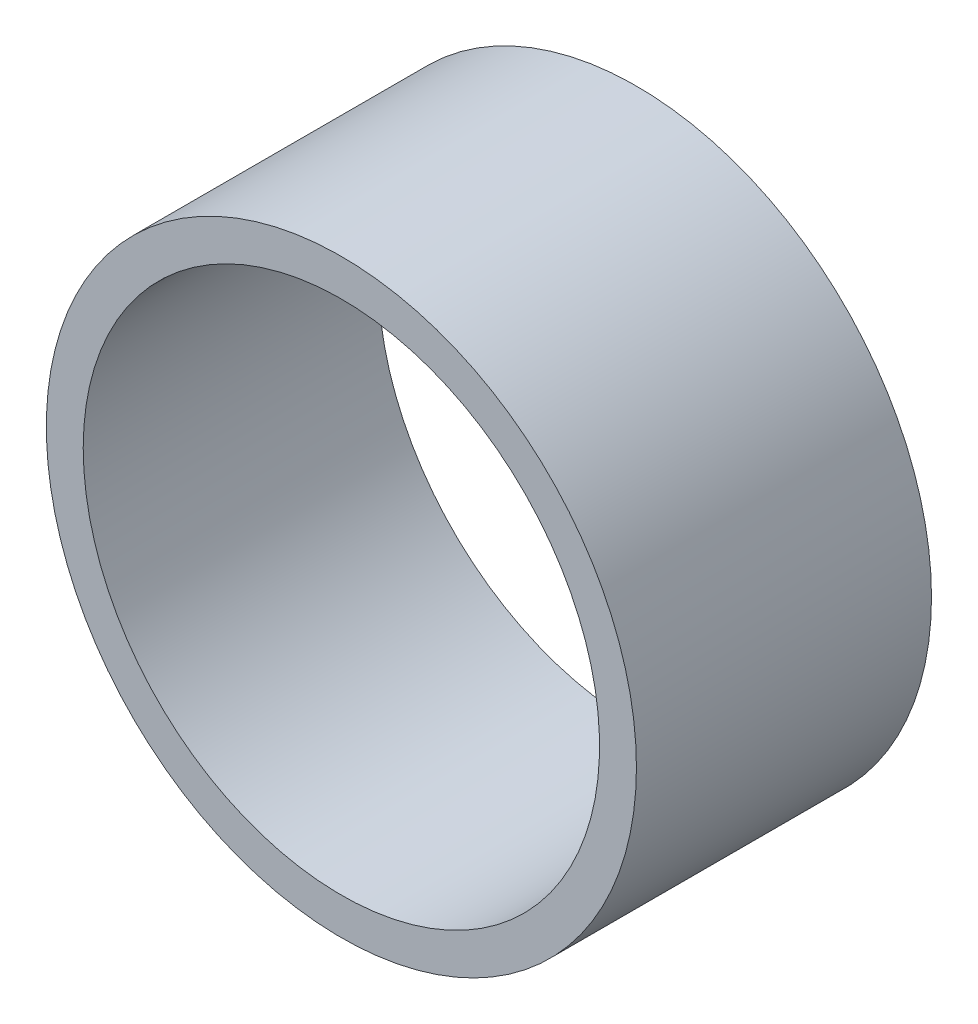
ISO-10303-21;
HEADER;
FILE_DESCRIPTION(('STEP AP214'),'2;1');
FILE_NAME('part.step','',(''),(''),'','','');
FILE_SCHEMA(('AUTOMOTIVE_DESIGN { 1 0 10303 214 1 1 1 1 }'));
ENDSEC;
DATA;
#1=APPLICATION_CONTEXT('core data for automotive mechanical design processes');
#2=APPLICATION_PROTOCOL_DEFINITION('international standard','automotive_design',2000,#1);
#3=PRODUCT_CONTEXT('',#1,'mechanical');
#4=PRODUCT('Part','Part','',(#3));
#5=PRODUCT_RELATED_PRODUCT_CATEGORY('part','',(#4));
#6=PRODUCT_DEFINITION_FORMATION('','',#4);
#7=PRODUCT_DEFINITION_CONTEXT('part definition',#1,'design');
#8=PRODUCT_DEFINITION('design','',#6,#7);
#9=PRODUCT_DEFINITION_SHAPE('','',#8);
#10=(LENGTH_UNIT() NAMED_UNIT(*) SI_UNIT(.MILLI.,.METRE.));
#11=(NAMED_UNIT(*) PLANE_ANGLE_UNIT() SI_UNIT($,.RADIAN.));
#12=(NAMED_UNIT(*) SI_UNIT($,.STERADIAN.) SOLID_ANGLE_UNIT());
#13=UNCERTAINTY_MEASURE_WITH_UNIT(LENGTH_MEASURE(1.E-05),#10,'distance_accuracy_value','');
#14=(GEOMETRIC_REPRESENTATION_CONTEXT(3) GLOBAL_UNCERTAINTY_ASSIGNED_CONTEXT((#13)) GLOBAL_UNIT_ASSIGNED_CONTEXT((#10,
#11,#12)) REPRESENTATION_CONTEXT('',''));
#15=CARTESIAN_POINT('',(0.,0.,0.));
#16=DIRECTION('',(0.,0.,1.));
#17=DIRECTION('',(1.,0.,0.));
#18=AXIS2_PLACEMENT_3D('',#15,#16,#17);
#19=CARTESIAN_POINT('',(0.,0.,16.));
#20=DIRECTION('',(0.,0.,-1.));
#21=DIRECTION('',(-1.,0.,0.));
#22=AXIS2_PLACEMENT_3D('',#19,#20,#21);
#23=CYLINDRICAL_SURFACE('',#22,16.);
#24=CARTESIAN_POINT('',(0.,0.,16.));
#25=DIRECTION('',(0.,0.,1.));
#26=DIRECTION('',(1.,0.,0.));
#27=AXIS2_PLACEMENT_3D('',#24,#25,#26);
#28=CIRCLE('',#27,16.);
#29=CARTESIAN_POINT('',(16.,0.,16.));
#30=VERTEX_POINT('',#29);
#31=EDGE_CURVE('E10',#30,#30,#28,.T.);
#32=ORIENTED_EDGE('',*,*,#31,.F.);
#33=EDGE_LOOP('',(#32));
#34=FACE_BOUND('',#33,.T.);
#35=CARTESIAN_POINT('',(0.,0.,0.));
#36=DIRECTION('',(0.,0.,1.));
#37=DIRECTION('',(1.,0.,0.));
#38=AXIS2_PLACEMENT_3D('',#35,#36,#37);
#39=CIRCLE('',#38,16.);
#40=CARTESIAN_POINT('',(16.,0.,0.));
#41=VERTEX_POINT('',#40);
#42=EDGE_CURVE('E36',#41,#41,#39,.T.);
#43=ORIENTED_EDGE('',*,*,#42,.T.);
#44=EDGE_LOOP('',(#43));
#45=FACE_BOUND('',#44,.T.);
#46=ADVANCED_FACE('F33',(#34,#45),#23,.T.);
#47=CARTESIAN_POINT('',(0.,0.,16.));
#48=DIRECTION('',(0.,0.,1.));
#49=DIRECTION('',(1.,0.,0.));
#50=AXIS2_PLACEMENT_3D('',#47,#48,#49);
#51=PLANE('',#50);
#52=CARTESIAN_POINT('',(0.,0.,16.));
#53=DIRECTION('',(0.,0.,-1.));
#54=DIRECTION('',(-1.,0.,0.));
#55=AXIS2_PLACEMENT_3D('',#52,#53,#54);
#56=CIRCLE('',#55,14.);
#57=CARTESIAN_POINT('',(-14.,0.,16.));
#58=VERTEX_POINT('',#57);
#59=EDGE_CURVE('E43',#58,#58,#56,.T.);
#60=ORIENTED_EDGE('',*,*,#59,.T.);
#61=EDGE_LOOP('',(#60));
#62=FACE_BOUND('',#61,.T.);
#63=ORIENTED_EDGE('',*,*,#31,.T.);
#64=EDGE_LOOP('',(#63));
#65=FACE_BOUND('',#64,.T.);
#66=ADVANCED_FACE('F51',(#62,#65),#51,.T.);
#67=CARTESIAN_POINT('',(0.,0.,0.));
#68=DIRECTION('',(0.,0.,1.));
#69=DIRECTION('',(1.,0.,0.));
#70=AXIS2_PLACEMENT_3D('',#67,#68,#69);
#71=PLANE('',#70);
#72=CARTESIAN_POINT('',(0.,0.,0.));
#73=DIRECTION('',(0.,0.,-1.));
#74=DIRECTION('',(-1.,0.,0.));
#75=AXIS2_PLACEMENT_3D('',#72,#73,#74);
#76=CIRCLE('',#75,14.);
#77=CARTESIAN_POINT('',(-14.,0.,0.));
#78=VERTEX_POINT('',#77);
#79=EDGE_CURVE('E45',#78,#78,#76,.T.);
#80=ORIENTED_EDGE('',*,*,#79,.F.);
#81=EDGE_LOOP('',(#80));
#82=FACE_BOUND('',#81,.T.);
#83=ORIENTED_EDGE('',*,*,#42,.F.);
#84=EDGE_LOOP('',(#83));
#85=FACE_BOUND('',#84,.T.);
#86=ADVANCED_FACE('F56',(#82,#85),#71,.F.);
#87=CARTESIAN_POINT('',(0.,0.,16.));
#88=DIRECTION('',(0.,0.,-1.));
#89=DIRECTION('',(-1.,0.,0.));
#90=AXIS2_PLACEMENT_3D('',#87,#88,#89);
#91=CYLINDRICAL_SURFACE('',#90,14.);
#92=ORIENTED_EDGE('',*,*,#59,.F.);
#93=EDGE_LOOP('',(#92));
#94=FACE_BOUND('',#93,.T.);
#95=ORIENTED_EDGE('',*,*,#79,.T.);
#96=EDGE_LOOP('',(#95));
#97=FACE_BOUND('',#96,.T.);
#98=ADVANCED_FACE('F53',(#94,#97),#91,.F.);
#99=CLOSED_SHELL('',(#46,#66,#86,#98));
#100=MANIFOLD_SOLID_BREP('B2',#99);
#101=ADVANCED_BREP_SHAPE_REPRESENTATION('',(#18,#100),#14);
#102=SHAPE_DEFINITION_REPRESENTATION(#9,#101);
ENDSEC;
END-ISO-10303-21;
